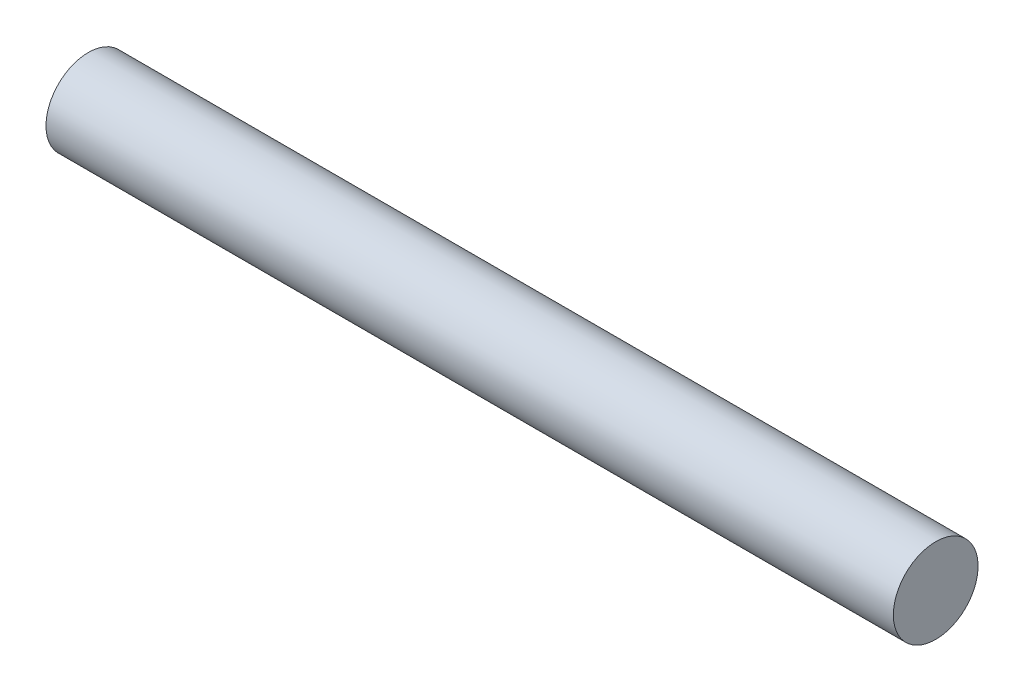
ISO-10303-21;
HEADER;
FILE_DESCRIPTION(('STEP AP214'),'2;1');
FILE_NAME('part.step','',(''),(''),'','','');
FILE_SCHEMA(('AUTOMOTIVE_DESIGN { 1 0 10303 214 1 1 1 1 }'));
ENDSEC;
DATA;
#1=APPLICATION_CONTEXT('core data for automotive mechanical design processes');
#2=APPLICATION_PROTOCOL_DEFINITION('international standard','automotive_design',2000,#1);
#3=PRODUCT_CONTEXT('',#1,'mechanical');
#4=PRODUCT('Part','Part','',(#3));
#5=PRODUCT_RELATED_PRODUCT_CATEGORY('part','',(#4));
#6=PRODUCT_DEFINITION_FORMATION('','',#4);
#7=PRODUCT_DEFINITION_CONTEXT('part definition',#1,'design');
#8=PRODUCT_DEFINITION('design','',#6,#7);
#9=PRODUCT_DEFINITION_SHAPE('','',#8);
#10=(LENGTH_UNIT() NAMED_UNIT(*) SI_UNIT(.MILLI.,.METRE.));
#11=(NAMED_UNIT(*) PLANE_ANGLE_UNIT() SI_UNIT($,.RADIAN.));
#12=(NAMED_UNIT(*) SI_UNIT($,.STERADIAN.) SOLID_ANGLE_UNIT());
#13=UNCERTAINTY_MEASURE_WITH_UNIT(LENGTH_MEASURE(1.E-05),#10,'distance_accuracy_value','');
#14=(GEOMETRIC_REPRESENTATION_CONTEXT(3) GLOBAL_UNCERTAINTY_ASSIGNED_CONTEXT((#13)) GLOBAL_UNIT_ASSIGNED_CONTEXT((#10,
#11,#12)) REPRESENTATION_CONTEXT('',''));
#15=CARTESIAN_POINT('',(0.,0.,0.));
#16=DIRECTION('',(0.,0.,1.));
#17=DIRECTION('',(1.,0.,0.));
#18=AXIS2_PLACEMENT_3D('',#15,#16,#17);
#19=CARTESIAN_POINT('',(351.894917120642,17.210842172948,-244.757061419668));
#20=DIRECTION('',(-1.,0.,0.));
#21=DIRECTION('',(0.,0.,1.));
#22=AXIS2_PLACEMENT_3D('',#19,#20,#21);
#23=PLANE('',#22);
#24=CARTESIAN_POINT('',(351.894917120642,43.3157017452683,-226.556360518351));
#25=DIRECTION('',(-1.,0.,0.));
#26=DIRECTION('',(0.,0.,1.));
#27=AXIS2_PLACEMENT_3D('',#24,#25,#26);
#28=CIRCLE('',#27,1.5);
#29=CARTESIAN_POINT('',(351.894917120642,43.3157017452683,-225.056360518351));
#30=VERTEX_POINT('',#29);
#31=EDGE_CURVE('E18',#30,#30,#28,.F.);
#32=ORIENTED_EDGE('',*,*,#31,.F.);
#33=EDGE_LOOP('',(#32));
#34=FACE_BOUND('',#33,.T.);
#35=ADVANCED_FACE('F15',(#34),#23,.T.);
#36=CARTESIAN_POINT('',(381.894917120642,17.210842172948,-244.757061419668));
#37=DIRECTION('',(-1.,0.,0.));
#38=DIRECTION('',(0.,0.,1.));
#39=AXIS2_PLACEMENT_3D('',#36,#37,#38);
#40=PLANE('',#39);
#41=CARTESIAN_POINT('',(381.894917120642,43.3157017452683,-226.556360518351));
#42=DIRECTION('',(-1.,0.,0.));
#43=DIRECTION('',(0.,0.,1.));
#44=AXIS2_PLACEMENT_3D('',#41,#42,#43);
#45=CIRCLE('',#44,1.5);
#46=CARTESIAN_POINT('',(381.894917120642,43.3157017452683,-225.056360518351));
#47=VERTEX_POINT('',#46);
#48=EDGE_CURVE('E10',#47,#47,#45,.T.);
#49=ORIENTED_EDGE('',*,*,#48,.F.);
#50=EDGE_LOOP('',(#49));
#51=FACE_BOUND('',#50,.T.);
#52=ADVANCED_FACE('F30',(#51),#40,.F.);
#53=CARTESIAN_POINT('',(363.894917120642,43.3157017452683,-226.556360518351));
#54=DIRECTION('',(-1.,0.,0.));
#55=DIRECTION('',(0.,0.,1.));
#56=AXIS2_PLACEMENT_3D('',#53,#54,#55);
#57=CYLINDRICAL_SURFACE('',#56,1.5);
#58=ORIENTED_EDGE('',*,*,#48,.T.);
#59=EDGE_LOOP('',(#58));
#60=FACE_BOUND('',#59,.T.);
#61=ORIENTED_EDGE('',*,*,#31,.T.);
#62=EDGE_LOOP('',(#61));
#63=FACE_BOUND('',#62,.T.);
#64=ADVANCED_FACE('F27',(#60,#63),#57,.T.);
#65=CLOSED_SHELL('',(#35,#52,#64));
#66=MANIFOLD_SOLID_BREP('B1',#65);
#67=ADVANCED_BREP_SHAPE_REPRESENTATION('',(#18,#66),#14);
#68=SHAPE_DEFINITION_REPRESENTATION(#9,#67);
ENDSEC;
END-ISO-10303-21;
